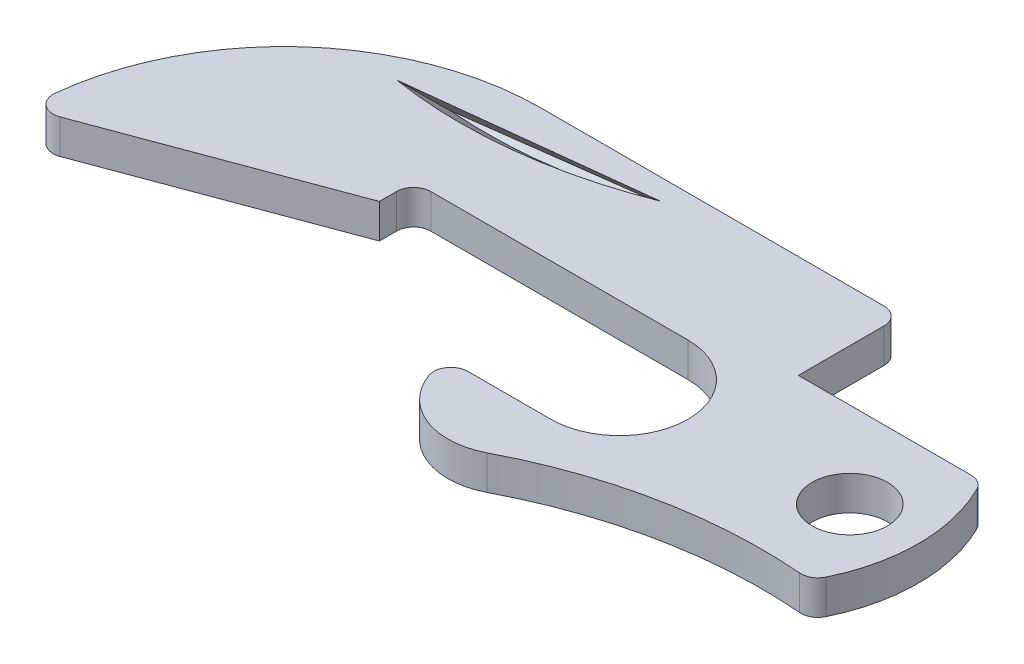
ISO-10303-21;
HEADER;
FILE_DESCRIPTION(('STEP AP214'),'2;1');
FILE_NAME('part.step','',(''),(''),'','','');
FILE_SCHEMA(('AUTOMOTIVE_DESIGN { 1 0 10303 214 1 1 1 1 }'));
ENDSEC;
DATA;
#1=APPLICATION_CONTEXT('core data for automotive mechanical design processes');
#2=APPLICATION_PROTOCOL_DEFINITION('international standard','automotive_design',2000,#1);
#3=PRODUCT_CONTEXT('',#1,'mechanical');
#4=PRODUCT('Part','Part','',(#3));
#5=PRODUCT_RELATED_PRODUCT_CATEGORY('part','',(#4));
#6=PRODUCT_DEFINITION_FORMATION('','',#4);
#7=PRODUCT_DEFINITION_CONTEXT('part definition',#1,'design');
#8=PRODUCT_DEFINITION('design','',#6,#7);
#9=PRODUCT_DEFINITION_SHAPE('','',#8);
#10=(LENGTH_UNIT() NAMED_UNIT(*) SI_UNIT(.MILLI.,.METRE.));
#11=(NAMED_UNIT(*) PLANE_ANGLE_UNIT() SI_UNIT($,.RADIAN.));
#12=(NAMED_UNIT(*) SI_UNIT($,.STERADIAN.) SOLID_ANGLE_UNIT());
#13=UNCERTAINTY_MEASURE_WITH_UNIT(LENGTH_MEASURE(1.E-05),#10,'distance_accuracy_value','');
#14=(GEOMETRIC_REPRESENTATION_CONTEXT(3) GLOBAL_UNCERTAINTY_ASSIGNED_CONTEXT((#13)) GLOBAL_UNIT_ASSIGNED_CONTEXT((#10,
#11,#12)) REPRESENTATION_CONTEXT('',''));
#15=CARTESIAN_POINT('',(0.,0.,0.));
#16=DIRECTION('',(0.,0.,1.));
#17=DIRECTION('',(1.,0.,0.));
#18=AXIS2_PLACEMENT_3D('',#15,#16,#17);
#19=CARTESIAN_POINT('',(-5.49926131403118,1.27,3.175));
#20=DIRECTION('',(0.,1.,0.));
#21=DIRECTION('',(0.,0.,1.));
#22=AXIS2_PLACEMENT_3D('',#19,#20,#21);
#23=PLANE('',#22);
#24=CARTESIAN_POINT('',(-21.1111470257286,1.27,-34.7456603659284));
#25=DIRECTION('',(0.,1.,0.));
#26=DIRECTION('',(0.,0.,1.));
#27=AXIS2_PLACEMENT_3D('',#24,#25,#26);
#28=ELLIPSE('',#27,32.9127154158025,23.1835650445405);
#29=CARTESIAN_POINT('',(-23.6735638427374,1.27000000000007,-2.03459824117952));
#30=VERTEX_POINT('',#29);
#31=CARTESIAN_POINT('',(-14.9129237600392,1.27,-3.03102283684994));
#32=VERTEX_POINT('',#31);
#33=EDGE_CURVE('E11',#30,#32,#28,.T.);
#34=ORIENTED_EDGE('',*,*,#33,.F.);
#35=DIRECTION('',(-0.993593832437609,0.,0.113010159463405));
#36=VECTOR('',#35,1.);
#37=CARTESIAN_POINT('',(-6.31633669052007,1.27,-4.00878824143583));
#38=LINE('',#37,#36);
#39=EDGE_CURVE('E46',#32,#30,#38,.T.);
#40=ORIENTED_EDGE('',*,*,#39,.F.);
#41=EDGE_LOOP('',(#34,#40));
#42=FACE_BOUND('',#41,.T.);
#43=DIRECTION('',(0.,0.,-1.));
#44=VECTOR('',#43,1.);
#45=CARTESIAN_POINT('',(-6.76926131403118,1.27,0.));
#46=LINE('',#45,#44);
#47=CARTESIAN_POINT('',(-6.76926131403118,1.27,0.));
#48=VERTEX_POINT('',#47);
#49=CARTESIAN_POINT('',(-6.76926131403118,1.27,-3.175));
#50=VERTEX_POINT('',#49);
#51=EDGE_CURVE('E205',#48,#50,#46,.T.);
#52=ORIENTED_EDGE('',*,*,#51,.T.);
#53=CARTESIAN_POINT('',(-7.40426131403118,1.27,-3.175));
#54=DIRECTION('',(0.,1.,0.));
#55=DIRECTION('',(0.,0.,1.));
#56=AXIS2_PLACEMENT_3D('',#53,#54,#55);
#57=CIRCLE('',#56,0.635);
#58=CARTESIAN_POINT('',(-7.40426131403118,1.27,-3.81));
#59=VERTEX_POINT('',#58);
#60=EDGE_CURVE('E297',#50,#59,#57,.T.);
#61=ORIENTED_EDGE('',*,*,#60,.T.);
#62=DIRECTION('',(-1.,0.,0.));
#63=VECTOR('',#62,1.);
#64=CARTESIAN_POINT('',(-6.76926131403118,1.27,-3.81));
#65=LINE('',#64,#63);
#66=CARTESIAN_POINT('',(-20.1042613140312,1.27,-3.81));
#67=VERTEX_POINT('',#66);
#68=EDGE_CURVE('E208',#59,#67,#65,.T.);
#69=ORIENTED_EDGE('',*,*,#68,.T.);
#70=CARTESIAN_POINT('',(-20.1042613140312,1.27,5.715));
#71=DIRECTION('',(0.,1.,0.));
#72=DIRECTION('',(0.,0.,1.));
#73=AXIS2_PLACEMENT_3D('',#70,#71,#72);
#74=CIRCLE('',#73,9.525);
#75=CARTESIAN_POINT('',(-29.5768648575385,1.27,4.71729908913937));
#76=VERTEX_POINT('',#75);
#77=EDGE_CURVE('E210',#67,#76,#74,.T.);
#78=ORIENTED_EDGE('',*,*,#77,.T.);
#79=CARTESIAN_POINT('',(-28.945357954638,1.27,4.78381248319674));
#80=DIRECTION('',(0.,1.,0.));
#81=DIRECTION('',(0.,0.,1.));
#82=AXIS2_PLACEMENT_3D('',#79,#80,#81);
#83=CIRCLE('',#82,0.635);
#84=CARTESIAN_POINT('',(-28.7243873064882,1.27,5.37912498319674));
#85=VERTEX_POINT('',#84);
#86=EDGE_CURVE('E295',#76,#85,#83,.T.);
#87=ORIENTED_EDGE('',*,*,#86,.T.);
#88=DIRECTION('',(0.937499999999999,0.,-0.347985272676879));
#89=VECTOR('',#88,1.);
#90=CARTESIAN_POINT('',(-29.6292613140312,1.27,5.715));
#91=LINE('',#90,#89);
#92=CARTESIAN_POINT('',(-20.1042613140312,1.27,2.17946962960292));
#93=VERTEX_POINT('',#92);
#94=EDGE_CURVE('E213',#85,#93,#91,.T.);
#95=ORIENTED_EDGE('',*,*,#94,.T.);
#96=DIRECTION('',(0.,0.,-1.));
#97=VECTOR('',#96,1.);
#98=CARTESIAN_POINT('',(-20.1042613140312,1.27,2.17946962960292));
#99=LINE('',#98,#97);
#100=CARTESIAN_POINT('',(-20.1042613140312,1.27,1.54446962960292));
#101=VERTEX_POINT('',#100);
#102=EDGE_CURVE('E215',#93,#101,#99,.T.);
#103=ORIENTED_EDGE('',*,*,#102,.T.);
#104=CARTESIAN_POINT('',(-19.4692613140312,1.27,1.54446962960292));
#105=DIRECTION('',(0.,1.,0.));
#106=DIRECTION('',(0.,0.,1.));
#107=AXIS2_PLACEMENT_3D('',#104,#105,#106);
#108=CIRCLE('',#107,0.635);
#109=CARTESIAN_POINT('',(-19.4692613140312,1.27,0.909469629602915));
#110=VERTEX_POINT('',#109);
#111=EDGE_CURVE('E325',#101,#110,#108,.F.);
#112=ORIENTED_EDGE('',*,*,#111,.T.);
#113=DIRECTION('',(1.,0.,0.));
#114=VECTOR('',#113,1.);
#115=CARTESIAN_POINT('',(-20.1042613140312,1.27,0.909469629602915));
#116=LINE('',#115,#114);
#117=CARTESIAN_POINT('',(-9.94426131403119,1.27,0.909469629602915));
#118=VERTEX_POINT('',#117);
#119=EDGE_CURVE('E218',#110,#118,#116,.T.);
#120=ORIENTED_EDGE('',*,*,#119,.T.);
#121=CARTESIAN_POINT('',(-9.94426131403119,1.27,3.44946962960292));
#122=DIRECTION('',(0.,-1.,0.));
#123=DIRECTION('',(0.,0.,-1.));
#124=AXIS2_PLACEMENT_3D('',#121,#122,#123);
#125=CIRCLE('',#124,2.54);
#126=CARTESIAN_POINT('',(-9.94426131403119,1.27,5.98946962960292));
#127=VERTEX_POINT('',#126);
#128=EDGE_CURVE('E220',#118,#127,#125,.T.);
#129=ORIENTED_EDGE('',*,*,#128,.T.);
#130=DIRECTION('',(-1.,0.,0.));
#131=VECTOR('',#130,1.);
#132=CARTESIAN_POINT('',(-9.94426131403119,1.27,5.98946962960292));
#133=LINE('',#132,#131);
#134=CARTESIAN_POINT('',(-13.010312538245,1.27,5.98946962960292));
#135=VERTEX_POINT('',#134);
#136=EDGE_CURVE('E222',#127,#135,#133,.T.);
#137=ORIENTED_EDGE('',*,*,#136,.T.);
#138=CARTESIAN_POINT('',(-13.010312538245,1.27,6.62446962960292));
#139=DIRECTION('',(0.,1.,0.));
#140=DIRECTION('',(0.,0.,1.));
#141=AXIS2_PLACEMENT_3D('',#138,#139,#140);
#142=CIRCLE('',#141,0.635);
#143=CARTESIAN_POINT('',(-13.6089962796496,1.27,6.83613629626958));
#144=VERTEX_POINT('',#143);
#145=EDGE_CURVE('E289',#135,#144,#142,.T.);
#146=ORIENTED_EDGE('',*,*,#145,.T.);
#147=CARTESIAN_POINT('',(-11.2142613140312,1.27,5.98946962960292));
#148=DIRECTION('',(0.,1.,0.));
#149=DIRECTION('',(0.,0.,1.));
#150=AXIS2_PLACEMENT_3D('',#147,#148,#149);
#151=CIRCLE('',#150,2.54);
#152=CARTESIAN_POINT('',(-10.0458046094695,1.27,8.24475429668263));
#153=VERTEX_POINT('',#152);
#154=EDGE_CURVE('E225',#144,#153,#151,.T.);
#155=ORIENTED_EDGE('',*,*,#154,.T.);
#156=CARTESIAN_POINT('',(-1.86660767753762,1.27,24.0317469662406));
#157=DIRECTION('',(0.,-1.,0.));
#158=DIRECTION('',(0.,0.,-1.));
#159=AXIS2_PLACEMENT_3D('',#156,#157,#158);
#160=CIRCLE('',#159,17.78);
#161=CARTESIAN_POINT('',(-0.41359624831094,1.27,6.31121769122916));
#162=VERTEX_POINT('',#161);
#163=EDGE_CURVE('E227',#153,#162,#160,.T.);
#164=ORIENTED_EDGE('',*,*,#163,.T.);
#165=CARTESIAN_POINT('',(-0.361702982981415,1.27,5.67834164569303));
#166=DIRECTION('',(0.,1.,0.));
#167=DIRECTION('',(0.,0.,1.));
#168=AXIS2_PLACEMENT_3D('',#165,#166,#167);
#169=CIRCLE('',#168,0.635);
#170=CARTESIAN_POINT('',(0.20913683157967,1.27,5.9564907174367));
#171=VERTEX_POINT('',#170);
#172=EDGE_CURVE('E291',#162,#171,#169,.T.);
#173=ORIENTED_EDGE('',*,*,#172,.T.);
#174=CARTESIAN_POINT('',(-5.49926131403118,1.27,3.175));
#175=DIRECTION('',(0.,1.,0.));
#176=DIRECTION('',(0.,0.,1.));
#177=AXIS2_PLACEMENT_3D('',#174,#175,#176);
#178=CIRCLE('',#177,6.35);
#179=CARTESIAN_POINT('',(0.189109430601681,1.27,0.352777777777778));
#180=VERTEX_POINT('',#179);
#181=EDGE_CURVE('E199',#171,#180,#178,.T.);
#182=ORIENTED_EDGE('',*,*,#181,.T.);
#183=CARTESIAN_POINT('',(-0.379727643861606,1.27,0.635));
#184=DIRECTION('',(0.,1.,0.));
#185=DIRECTION('',(0.,0.,1.));
#186=AXIS2_PLACEMENT_3D('',#183,#184,#185);
#187=CIRCLE('',#186,0.635);
#188=CARTESIAN_POINT('',(-0.379727643861606,1.27,0.));
#189=VERTEX_POINT('',#188);
#190=EDGE_CURVE('E293',#180,#189,#187,.T.);
#191=ORIENTED_EDGE('',*,*,#190,.T.);
#192=DIRECTION('',(-1.,0.,0.));
#193=VECTOR('',#192,1.);
#194=CARTESIAN_POINT('',(0.,1.27,0.));
#195=LINE('',#194,#193);
#196=EDGE_CURVE('E202',#189,#48,#195,.T.);
#197=ORIENTED_EDGE('',*,*,#196,.T.);
#198=EDGE_LOOP('',(#52,#61,#69,#78,#87,#95,#103,#112,#120,#129,#137,#146,#155,#164,#173,#182,
#191,#197));
#199=FACE_BOUND('',#198,.T.);
#200=CARTESIAN_POINT('',(-1.68926131403119,1.27,3.175));
#201=DIRECTION('',(0.,1.,0.));
#202=DIRECTION('',(0.,0.,1.));
#203=AXIS2_PLACEMENT_3D('',#200,#201,#202);
#204=CIRCLE('',#203,1.397);
#205=CARTESIAN_POINT('',(-1.68926131403119,1.27,4.572));
#206=VERTEX_POINT('',#205);
#207=EDGE_CURVE('E193',#206,#206,#204,.T.);
#208=ORIENTED_EDGE('',*,*,#207,.F.);
#209=EDGE_LOOP('',(#208));
#210=FACE_BOUND('',#209,.T.);
#211=ADVANCED_FACE('F38',(#42,#199,#210),#23,.T.);
#212=CARTESIAN_POINT('',(-5.49926131403118,0.,3.175));
#213=DIRECTION('',(0.,1.,0.));
#214=DIRECTION('',(0.,0.,1.));
#215=AXIS2_PLACEMENT_3D('',#212,#213,#214);
#216=PLANE('',#215);
#217=DIRECTION('',(-1.,0.,0.));
#218=VECTOR('',#217,1.);
#219=CARTESIAN_POINT('',(-6.76926131403118,0.,-3.81));
#220=LINE('',#219,#218);
#221=CARTESIAN_POINT('',(-7.40426131403118,0.,-3.81));
#222=VERTEX_POINT('',#221);
#223=CARTESIAN_POINT('',(-20.1042613140312,0.,-3.81));
#224=VERTEX_POINT('',#223);
#225=EDGE_CURVE('E237',#222,#224,#220,.T.);
#226=ORIENTED_EDGE('',*,*,#225,.F.);
#227=CARTESIAN_POINT('',(-7.40426131403118,0.,-3.175));
#228=DIRECTION('',(0.,1.,0.));
#229=DIRECTION('',(0.,0.,1.));
#230=AXIS2_PLACEMENT_3D('',#227,#228,#229);
#231=CIRCLE('',#230,0.635);
#232=CARTESIAN_POINT('',(-6.76926131403118,0.,-3.175));
#233=VERTEX_POINT('',#232);
#234=EDGE_CURVE('E285',#222,#233,#231,.F.);
#235=ORIENTED_EDGE('',*,*,#234,.T.);
#236=DIRECTION('',(0.,0.,-1.));
#237=VECTOR('',#236,1.);
#238=CARTESIAN_POINT('',(-6.76926131403118,0.,0.));
#239=LINE('',#238,#237);
#240=CARTESIAN_POINT('',(-6.76926131403118,0.,0.));
#241=VERTEX_POINT('',#240);
#242=EDGE_CURVE('E234',#241,#233,#239,.T.);
#243=ORIENTED_EDGE('',*,*,#242,.F.);
#244=DIRECTION('',(-1.,0.,0.));
#245=VECTOR('',#244,1.);
#246=CARTESIAN_POINT('',(0.,0.,0.));
#247=LINE('',#246,#245);
#248=CARTESIAN_POINT('',(-0.379727643861606,0.,0.));
#249=VERTEX_POINT('',#248);
#250=EDGE_CURVE('E232',#249,#241,#247,.T.);
#251=ORIENTED_EDGE('',*,*,#250,.F.);
#252=CARTESIAN_POINT('',(-0.379727643861606,0.,0.635));
#253=DIRECTION('',(0.,1.,0.));
#254=DIRECTION('',(0.,0.,1.));
#255=AXIS2_PLACEMENT_3D('',#252,#253,#254);
#256=CIRCLE('',#255,0.635);
#257=CARTESIAN_POINT('',(0.189109430601681,0.,0.352777777777778));
#258=VERTEX_POINT('',#257);
#259=EDGE_CURVE('E281',#249,#258,#256,.F.);
#260=ORIENTED_EDGE('',*,*,#259,.T.);
#261=CARTESIAN_POINT('',(-5.49926131403118,0.,3.175));
#262=DIRECTION('',(0.,1.,0.));
#263=DIRECTION('',(0.,0.,1.));
#264=AXIS2_PLACEMENT_3D('',#261,#262,#263);
#265=CIRCLE('',#264,6.35);
#266=CARTESIAN_POINT('',(0.20913683157967,0.,5.9564907174367));
#267=VERTEX_POINT('',#266);
#268=EDGE_CURVE('E196',#267,#258,#265,.T.);
#269=ORIENTED_EDGE('',*,*,#268,.F.);
#270=CARTESIAN_POINT('',(-0.361702982981415,0.,5.67834164569303));
#271=DIRECTION('',(0.,1.,0.));
#272=DIRECTION('',(0.,0.,1.));
#273=AXIS2_PLACEMENT_3D('',#270,#271,#272);
#274=CIRCLE('',#273,0.635);
#275=CARTESIAN_POINT('',(-0.41359624831094,0.,6.31121769122916));
#276=VERTEX_POINT('',#275);
#277=EDGE_CURVE('E279',#267,#276,#274,.F.);
#278=ORIENTED_EDGE('',*,*,#277,.T.);
#279=CARTESIAN_POINT('',(-1.86660767753762,0.,24.0317469662406));
#280=DIRECTION('',(0.,-1.,0.));
#281=DIRECTION('',(0.,0.,-1.));
#282=AXIS2_PLACEMENT_3D('',#279,#280,#281);
#283=CIRCLE('',#282,17.78);
#284=CARTESIAN_POINT('',(-10.0458046094695,0.,8.24475429668263));
#285=VERTEX_POINT('',#284);
#286=EDGE_CURVE('E203',#285,#276,#283,.T.);
#287=ORIENTED_EDGE('',*,*,#286,.F.);
#288=CARTESIAN_POINT('',(-11.2142613140312,0.,5.98946962960292));
#289=DIRECTION('',(0.,1.,0.));
#290=DIRECTION('',(0.,0.,1.));
#291=AXIS2_PLACEMENT_3D('',#288,#289,#290);
#292=CIRCLE('',#291,2.54);
#293=CARTESIAN_POINT('',(-13.6089962796496,0.,6.83613629626958));
#294=VERTEX_POINT('',#293);
#295=EDGE_CURVE('E254',#294,#285,#292,.T.);
#296=ORIENTED_EDGE('',*,*,#295,.F.);
#297=CARTESIAN_POINT('',(-13.010312538245,0.,6.62446962960292));
#298=DIRECTION('',(0.,1.,0.));
#299=DIRECTION('',(0.,0.,1.));
#300=AXIS2_PLACEMENT_3D('',#297,#298,#299);
#301=CIRCLE('',#300,0.635);
#302=CARTESIAN_POINT('',(-13.010312538245,0.,5.98946962960292));
#303=VERTEX_POINT('',#302);
#304=EDGE_CURVE('E277',#294,#303,#301,.F.);
#305=ORIENTED_EDGE('',*,*,#304,.T.);
#306=DIRECTION('',(-1.,0.,0.));
#307=VECTOR('',#306,1.);
#308=CARTESIAN_POINT('',(-9.94426131403119,0.,5.98946962960292));
#309=LINE('',#308,#307);
#310=CARTESIAN_POINT('',(-9.94426131403119,0.,5.98946962960292));
#311=VERTEX_POINT('',#310);
#312=EDGE_CURVE('E251',#311,#303,#309,.T.);
#313=ORIENTED_EDGE('',*,*,#312,.F.);
#314=CARTESIAN_POINT('',(-9.94426131403119,0.,3.44946962960292));
#315=DIRECTION('',(0.,-1.,0.));
#316=DIRECTION('',(0.,0.,-1.));
#317=AXIS2_PLACEMENT_3D('',#314,#315,#316);
#318=CIRCLE('',#317,2.54);
#319=CARTESIAN_POINT('',(-9.94426131403119,0.,0.909469629602915));
#320=VERTEX_POINT('',#319);
#321=EDGE_CURVE('E249',#320,#311,#318,.T.);
#322=ORIENTED_EDGE('',*,*,#321,.F.);
#323=DIRECTION('',(1.,0.,0.));
#324=VECTOR('',#323,1.);
#325=CARTESIAN_POINT('',(-20.1042613140312,0.,0.909469629602915));
#326=LINE('',#325,#324);
#327=CARTESIAN_POINT('',(-19.4692613140312,0.,0.909469629602915));
#328=VERTEX_POINT('',#327);
#329=EDGE_CURVE('E247',#328,#320,#326,.T.);
#330=ORIENTED_EDGE('',*,*,#329,.F.);
#331=CARTESIAN_POINT('',(-19.4692613140312,0.,1.54446962960292));
#332=DIRECTION('',(0.,1.,0.));
#333=DIRECTION('',(0.,0.,1.));
#334=AXIS2_PLACEMENT_3D('',#331,#332,#333);
#335=CIRCLE('',#334,0.635);
#336=CARTESIAN_POINT('',(-20.1042613140312,0.,1.54446962960292));
#337=VERTEX_POINT('',#336);
#338=EDGE_CURVE('E323',#328,#337,#335,.T.);
#339=ORIENTED_EDGE('',*,*,#338,.T.);
#340=DIRECTION('',(0.,0.,-1.));
#341=VECTOR('',#340,1.);
#342=CARTESIAN_POINT('',(-20.1042613140312,0.,2.17946962960292));
#343=LINE('',#342,#341);
#344=CARTESIAN_POINT('',(-20.1042613140312,0.,2.17946962960292));
#345=VERTEX_POINT('',#344);
#346=EDGE_CURVE('E244',#345,#337,#343,.T.);
#347=ORIENTED_EDGE('',*,*,#346,.F.);
#348=DIRECTION('',(0.937499999999999,0.,-0.347985272676879));
#349=VECTOR('',#348,1.);
#350=CARTESIAN_POINT('',(-29.6292613140312,0.,5.715));
#351=LINE('',#350,#349);
#352=CARTESIAN_POINT('',(-28.7243873064882,0.,5.37912498319674));
#353=VERTEX_POINT('',#352);
#354=EDGE_CURVE('E242',#353,#345,#351,.T.);
#355=ORIENTED_EDGE('',*,*,#354,.F.);
#356=CARTESIAN_POINT('',(-28.945357954638,0.,4.78381248319674));
#357=DIRECTION('',(0.,1.,0.));
#358=DIRECTION('',(0.,0.,1.));
#359=AXIS2_PLACEMENT_3D('',#356,#357,#358);
#360=CIRCLE('',#359,0.635);
#361=CARTESIAN_POINT('',(-29.5768648575385,0.,4.71729908913937));
#362=VERTEX_POINT('',#361);
#363=EDGE_CURVE('E283',#353,#362,#360,.F.);
#364=ORIENTED_EDGE('',*,*,#363,.T.);
#365=CARTESIAN_POINT('',(-20.1042613140312,0.,5.715));
#366=DIRECTION('',(0.,1.,0.));
#367=DIRECTION('',(0.,0.,1.));
#368=AXIS2_PLACEMENT_3D('',#365,#366,#367);
#369=CIRCLE('',#368,9.525);
#370=EDGE_CURVE('E239',#224,#362,#369,.T.);
#371=ORIENTED_EDGE('',*,*,#370,.F.);
#372=EDGE_LOOP('',(#226,#235,#243,#251,#260,#269,#278,#287,#296,#305,#313,#322,#330,#339,#347,
#355,#364,#371));
#373=FACE_BOUND('',#372,.T.);
#374=CARTESIAN_POINT('',(-1.68926131403119,0.,3.175));
#375=DIRECTION('',(0.,1.,0.));
#376=DIRECTION('',(0.,0.,1.));
#377=AXIS2_PLACEMENT_3D('',#374,#375,#376);
#378=CIRCLE('',#377,1.397);
#379=CARTESIAN_POINT('',(-1.68926131403119,0.,4.572));
#380=VERTEX_POINT('',#379);
#381=EDGE_CURVE('E182',#380,#380,#378,.T.);
#382=ORIENTED_EDGE('',*,*,#381,.T.);
#383=EDGE_LOOP('',(#382));
#384=FACE_BOUND('',#383,.T.);
#385=ADVANCED_FACE('F342',(#373,#384),#216,.F.);
#386=CARTESIAN_POINT('',(-5.49926131403118,1.27,3.175));
#387=DIRECTION('',(0.,-1.,0.));
#388=DIRECTION('',(0.,0.,-1.));
#389=AXIS2_PLACEMENT_3D('',#386,#387,#388);
#390=CYLINDRICAL_SURFACE('',#389,6.35);
#391=ORIENTED_EDGE('',*,*,#268,.T.);
#392=DIRECTION('',(0.,-1.,0.));
#393=VECTOR('',#392,1.);
#394=CARTESIAN_POINT('',(0.189109430601681,1.27,0.352777777777778));
#395=LINE('',#394,#393);
#396=EDGE_CURVE('E310',#258,#180,#395,.F.);
#397=ORIENTED_EDGE('',*,*,#396,.T.);
#398=ORIENTED_EDGE('',*,*,#181,.F.);
#399=DIRECTION('',(0.,-1.,0.));
#400=VECTOR('',#399,1.);
#401=CARTESIAN_POINT('',(0.209136831579671,1.27,5.9564907174367));
#402=LINE('',#401,#400);
#403=EDGE_CURVE('E307',#171,#267,#402,.T.);
#404=ORIENTED_EDGE('',*,*,#403,.T.);
#405=EDGE_LOOP('',(#391,#397,#398,#404));
#406=FACE_BOUND('',#405,.T.);
#407=ADVANCED_FACE('F397',(#406),#390,.T.);
#408=CARTESIAN_POINT('',(0.,1.27,0.));
#409=DIRECTION('',(0.,0.,1.));
#410=DIRECTION('',(1.,0.,0.));
#411=AXIS2_PLACEMENT_3D('',#408,#409,#410);
#412=PLANE('',#411);
#413=ORIENTED_EDGE('',*,*,#196,.F.);
#414=DIRECTION('',(0.,-1.,0.));
#415=VECTOR('',#414,1.);
#416=CARTESIAN_POINT('',(-0.379727643861606,1.27,0.));
#417=LINE('',#416,#415);
#418=EDGE_CURVE('E304',#189,#249,#417,.T.);
#419=ORIENTED_EDGE('',*,*,#418,.T.);
#420=ORIENTED_EDGE('',*,*,#250,.T.);
#421=DIRECTION('',(0.,-1.,0.));
#422=VECTOR('',#421,1.);
#423=CARTESIAN_POINT('',(-6.76926131403118,1.27,0.));
#424=LINE('',#423,#422);
#425=EDGE_CURVE('E271',#48,#241,#424,.T.);
#426=ORIENTED_EDGE('',*,*,#425,.F.);
#427=EDGE_LOOP('',(#413,#419,#420,#426));
#428=FACE_BOUND('',#427,.T.);
#429=ADVANCED_FACE('F427',(#428),#412,.F.);
#430=CARTESIAN_POINT('',(-6.76926131403118,1.27,0.));
#431=DIRECTION('',(-1.,0.,0.));
#432=DIRECTION('',(0.,0.,1.));
#433=AXIS2_PLACEMENT_3D('',#430,#431,#432);
#434=PLANE('',#433);
#435=ORIENTED_EDGE('',*,*,#242,.T.);
#436=DIRECTION('',(0.,-1.,0.));
#437=VECTOR('',#436,1.);
#438=CARTESIAN_POINT('',(-6.76926131403118,1.27,-3.175));
#439=LINE('',#438,#437);
#440=EDGE_CURVE('E287',#233,#50,#439,.F.);
#441=ORIENTED_EDGE('',*,*,#440,.T.);
#442=ORIENTED_EDGE('',*,*,#51,.F.);
#443=ORIENTED_EDGE('',*,*,#425,.T.);
#444=EDGE_LOOP('',(#435,#441,#442,#443));
#445=FACE_BOUND('',#444,.T.);
#446=ADVANCED_FACE('F372',(#445),#434,.F.);
#447=CARTESIAN_POINT('',(-6.76926131403118,1.27,-3.81));
#448=DIRECTION('',(0.,0.,1.));
#449=DIRECTION('',(1.,0.,0.));
#450=AXIS2_PLACEMENT_3D('',#447,#448,#449);
#451=PLANE('',#450);
#452=ORIENTED_EDGE('',*,*,#68,.F.);
#453=DIRECTION('',(0.,-1.,0.));
#454=VECTOR('',#453,1.);
#455=CARTESIAN_POINT('',(-7.40426131403118,1.27,-3.81));
#456=LINE('',#455,#454);
#457=EDGE_CURVE('E274',#59,#222,#456,.T.);
#458=ORIENTED_EDGE('',*,*,#457,.T.);
#459=ORIENTED_EDGE('',*,*,#225,.T.);
#460=DIRECTION('',(0.,-1.,0.));
#461=VECTOR('',#460,1.);
#462=CARTESIAN_POINT('',(-20.1042613140312,1.27,-3.81));
#463=LINE('',#462,#461);
#464=EDGE_CURVE('E268',#67,#224,#463,.T.);
#465=ORIENTED_EDGE('',*,*,#464,.F.);
#466=EDGE_LOOP('',(#452,#458,#459,#465));
#467=FACE_BOUND('',#466,.T.);
#468=ADVANCED_FACE('F366',(#467),#451,.F.);
#469=CARTESIAN_POINT('',(-20.1042613140312,1.27,5.715));
#470=DIRECTION('',(0.,-1.,0.));
#471=DIRECTION('',(0.,0.,-1.));
#472=AXIS2_PLACEMENT_3D('',#469,#470,#471);
#473=CYLINDRICAL_SURFACE('',#472,9.525);
#474=ORIENTED_EDGE('',*,*,#370,.T.);
#475=DIRECTION('',(0.,-1.,0.));
#476=VECTOR('',#475,1.);
#477=CARTESIAN_POINT('',(-29.5768648575385,1.27,4.71729908913937));
#478=LINE('',#477,#476);
#479=EDGE_CURVE('E302',#362,#76,#478,.F.);
#480=ORIENTED_EDGE('',*,*,#479,.T.);
#481=ORIENTED_EDGE('',*,*,#77,.F.);
#482=ORIENTED_EDGE('',*,*,#464,.T.);
#483=EDGE_LOOP('',(#474,#480,#481,#482));
#484=FACE_BOUND('',#483,.T.);
#485=ADVANCED_FACE('F357',(#484),#473,.T.);
#486=CARTESIAN_POINT('',(-29.6292613140312,1.27,5.715));
#487=DIRECTION('',(-0.347985272676879,0.,-0.937499999999999));
#488=DIRECTION('',(-0.937499999999999,0.,0.347985272676879));
#489=AXIS2_PLACEMENT_3D('',#486,#487,#488);
#490=PLANE('',#489);
#491=ORIENTED_EDGE('',*,*,#94,.F.);
#492=DIRECTION('',(0.,-1.,0.));
#493=VECTOR('',#492,1.);
#494=CARTESIAN_POINT('',(-28.7243873064882,1.27,5.37912498319674));
#495=LINE('',#494,#493);
#496=EDGE_CURVE('E299',#85,#353,#495,.T.);
#497=ORIENTED_EDGE('',*,*,#496,.T.);
#498=ORIENTED_EDGE('',*,*,#354,.T.);
#499=DIRECTION('',(0.,-1.,0.));
#500=VECTOR('',#499,1.);
#501=CARTESIAN_POINT('',(-20.1042613140312,1.27,2.17946962960292));
#502=LINE('',#501,#500);
#503=EDGE_CURVE('E265',#93,#345,#502,.T.);
#504=ORIENTED_EDGE('',*,*,#503,.F.);
#505=EDGE_LOOP('',(#491,#497,#498,#504));
#506=FACE_BOUND('',#505,.T.);
#507=ADVANCED_FACE('F351',(#506),#490,.F.);
#508=CARTESIAN_POINT('',(-20.1042613140312,1.27,2.17946962960292));
#509=DIRECTION('',(-1.,0.,0.));
#510=DIRECTION('',(0.,0.,1.));
#511=AXIS2_PLACEMENT_3D('',#508,#509,#510);
#512=PLANE('',#511);
#513=ORIENTED_EDGE('',*,*,#346,.T.);
#514=DIRECTION('',(0.,-1.,0.));
#515=VECTOR('',#514,1.);
#516=CARTESIAN_POINT('',(-20.1042613140312,1.27,1.54446962960292));
#517=LINE('',#516,#515);
#518=EDGE_CURVE('E321',#337,#101,#517,.F.);
#519=ORIENTED_EDGE('',*,*,#518,.T.);
#520=ORIENTED_EDGE('',*,*,#102,.F.);
#521=ORIENTED_EDGE('',*,*,#503,.T.);
#522=EDGE_LOOP('',(#513,#519,#520,#521));
#523=FACE_BOUND('',#522,.T.);
#524=ADVANCED_FACE('F347',(#523),#512,.F.);
#525=CARTESIAN_POINT('',(-20.1042613140312,1.27,0.909469629602915));
#526=DIRECTION('',(0.,0.,-1.));
#527=DIRECTION('',(-1.,0.,0.));
#528=AXIS2_PLACEMENT_3D('',#525,#526,#527);
#529=PLANE('',#528);
#530=ORIENTED_EDGE('',*,*,#119,.F.);
#531=DIRECTION('',(0.,-1.,0.));
#532=VECTOR('',#531,1.);
#533=CARTESIAN_POINT('',(-19.4692613140312,0.,0.909469629602915));
#534=LINE('',#533,#532);
#535=EDGE_CURVE('E318',#110,#328,#534,.T.);
#536=ORIENTED_EDGE('',*,*,#535,.T.);
#537=ORIENTED_EDGE('',*,*,#329,.T.);
#538=DIRECTION('',(0.,-1.,0.));
#539=VECTOR('',#538,1.);
#540=CARTESIAN_POINT('',(-9.94426131403119,1.27,0.909469629602915));
#541=LINE('',#540,#539);
#542=EDGE_CURVE('E262',#118,#320,#541,.T.);
#543=ORIENTED_EDGE('',*,*,#542,.F.);
#544=EDGE_LOOP('',(#530,#536,#537,#543));
#545=FACE_BOUND('',#544,.T.);
#546=ADVANCED_FACE('F336',(#545),#529,.F.);
#547=CARTESIAN_POINT('',(-9.94426131403119,1.27,3.44946962960292));
#548=DIRECTION('',(0.,-1.,0.));
#549=DIRECTION('',(0.,0.,-1.));
#550=AXIS2_PLACEMENT_3D('',#547,#548,#549);
#551=CYLINDRICAL_SURFACE('',#550,2.54);
#552=ORIENTED_EDGE('',*,*,#321,.T.);
#553=DIRECTION('',(0.,-1.,0.));
#554=VECTOR('',#553,1.);
#555=CARTESIAN_POINT('',(-9.94426131403119,1.27,5.98946962960292));
#556=LINE('',#555,#554);
#557=EDGE_CURVE('E259',#127,#311,#556,.T.);
#558=ORIENTED_EDGE('',*,*,#557,.F.);
#559=ORIENTED_EDGE('',*,*,#128,.F.);
#560=ORIENTED_EDGE('',*,*,#542,.T.);
#561=EDGE_LOOP('',(#552,#558,#559,#560));
#562=FACE_BOUND('',#561,.T.);
#563=ADVANCED_FACE('F410',(#562),#551,.F.);
#564=CARTESIAN_POINT('',(-9.94426131403119,1.27,5.98946962960292));
#565=DIRECTION('',(0.,0.,1.));
#566=DIRECTION('',(1.,0.,0.));
#567=AXIS2_PLACEMENT_3D('',#564,#565,#566);
#568=PLANE('',#567);
#569=ORIENTED_EDGE('',*,*,#312,.T.);
#570=DIRECTION('',(0.,-1.,0.));
#571=VECTOR('',#570,1.);
#572=CARTESIAN_POINT('',(-13.010312538245,1.27,5.98946962960292));
#573=LINE('',#572,#571);
#574=EDGE_CURVE('E316',#303,#135,#573,.F.);
#575=ORIENTED_EDGE('',*,*,#574,.T.);
#576=ORIENTED_EDGE('',*,*,#136,.F.);
#577=ORIENTED_EDGE('',*,*,#557,.T.);
#578=EDGE_LOOP('',(#569,#575,#576,#577));
#579=FACE_BOUND('',#578,.T.);
#580=ADVANCED_FACE('F406',(#579),#568,.F.);
#581=CARTESIAN_POINT('',(-11.2142613140312,1.27,5.98946962960292));
#582=DIRECTION('',(0.,-1.,0.));
#583=DIRECTION('',(0.,0.,-1.));
#584=AXIS2_PLACEMENT_3D('',#581,#582,#583);
#585=CYLINDRICAL_SURFACE('',#584,2.54);
#586=ORIENTED_EDGE('',*,*,#154,.F.);
#587=DIRECTION('',(0.,-1.,0.));
#588=VECTOR('',#587,1.);
#589=CARTESIAN_POINT('',(-13.6089962796496,1.27,6.83613629626958));
#590=LINE('',#589,#588);
#591=EDGE_CURVE('E313',#144,#294,#590,.T.);
#592=ORIENTED_EDGE('',*,*,#591,.T.);
#593=ORIENTED_EDGE('',*,*,#295,.T.);
#594=DIRECTION('',(0.,-1.,0.));
#595=VECTOR('',#594,1.);
#596=CARTESIAN_POINT('',(-10.0458046094695,1.27,8.24475429668263));
#597=LINE('',#596,#595);
#598=EDGE_CURVE('E229',#153,#285,#597,.T.);
#599=ORIENTED_EDGE('',*,*,#598,.F.);
#600=EDGE_LOOP('',(#586,#592,#593,#599));
#601=FACE_BOUND('',#600,.T.);
#602=ADVANCED_FACE('F403',(#601),#585,.T.);
#603=CARTESIAN_POINT('',(-1.86660767753762,1.27,24.0317469662406));
#604=DIRECTION('',(0.,-1.,0.));
#605=DIRECTION('',(0.,0.,-1.));
#606=AXIS2_PLACEMENT_3D('',#603,#604,#605);
#607=CYLINDRICAL_SURFACE('',#606,17.78);
#608=ORIENTED_EDGE('',*,*,#286,.T.);
#609=DIRECTION('',(0.,-1.,0.));
#610=VECTOR('',#609,1.);
#611=CARTESIAN_POINT('',(-0.41359624831094,1.27,6.31121769122915));
#612=LINE('',#611,#610);
#613=EDGE_CURVE('E60',#276,#162,#612,.F.);
#614=ORIENTED_EDGE('',*,*,#613,.T.);
#615=ORIENTED_EDGE('',*,*,#163,.F.);
#616=ORIENTED_EDGE('',*,*,#598,.T.);
#617=EDGE_LOOP('',(#608,#614,#615,#616));
#618=FACE_BOUND('',#617,.T.);
#619=ADVANCED_FACE('F385',(#618),#607,.F.);
#620=CARTESIAN_POINT('',(-1.68926131403119,1.27,3.175));
#621=DIRECTION('',(0.,-1.,0.));
#622=DIRECTION('',(0.,0.,-1.));
#623=AXIS2_PLACEMENT_3D('',#620,#621,#622);
#624=CYLINDRICAL_SURFACE('',#623,1.397);
#625=ORIENTED_EDGE('',*,*,#207,.T.);
#626=EDGE_LOOP('',(#625));
#627=FACE_BOUND('',#626,.T.);
#628=ORIENTED_EDGE('',*,*,#381,.F.);
#629=EDGE_LOOP('',(#628));
#630=FACE_BOUND('',#629,.T.);
#631=ADVANCED_FACE('F377',(#627,#630),#624,.F.);
#632=CARTESIAN_POINT('',(-7.40426131403118,1.27,-3.175));
#633=DIRECTION('',(0.,-1.,0.));
#634=DIRECTION('',(0.,0.,-1.));
#635=AXIS2_PLACEMENT_3D('',#632,#633,#634);
#636=CYLINDRICAL_SURFACE('',#635,0.635);
#637=ORIENTED_EDGE('',*,*,#60,.F.);
#638=ORIENTED_EDGE('',*,*,#440,.F.);
#639=ORIENTED_EDGE('',*,*,#234,.F.);
#640=ORIENTED_EDGE('',*,*,#457,.F.);
#641=EDGE_LOOP('',(#637,#638,#639,#640));
#642=FACE_BOUND('',#641,.T.);
#643=ADVANCED_FACE('F375',(#642),#636,.T.);
#644=CARTESIAN_POINT('',(-28.945357954638,1.27,4.78381248319674));
#645=DIRECTION('',(0.,-1.,0.));
#646=DIRECTION('',(0.,0.,-1.));
#647=AXIS2_PLACEMENT_3D('',#644,#645,#646);
#648=CYLINDRICAL_SURFACE('',#647,0.635);
#649=ORIENTED_EDGE('',*,*,#86,.F.);
#650=ORIENTED_EDGE('',*,*,#479,.F.);
#651=ORIENTED_EDGE('',*,*,#363,.F.);
#652=ORIENTED_EDGE('',*,*,#496,.F.);
#653=EDGE_LOOP('',(#649,#650,#651,#652));
#654=FACE_BOUND('',#653,.T.);
#655=ADVANCED_FACE('F361',(#654),#648,.T.);
#656=CARTESIAN_POINT('',(-0.379727643861606,1.27,0.635));
#657=DIRECTION('',(0.,-1.,0.));
#658=DIRECTION('',(0.,0.,-1.));
#659=AXIS2_PLACEMENT_3D('',#656,#657,#658);
#660=CYLINDRICAL_SURFACE('',#659,0.635);
#661=ORIENTED_EDGE('',*,*,#190,.F.);
#662=ORIENTED_EDGE('',*,*,#396,.F.);
#663=ORIENTED_EDGE('',*,*,#259,.F.);
#664=ORIENTED_EDGE('',*,*,#418,.F.);
#665=EDGE_LOOP('',(#661,#662,#663,#664));
#666=FACE_BOUND('',#665,.T.);
#667=ADVANCED_FACE('F383',(#666),#660,.T.);
#668=CARTESIAN_POINT('',(-0.361702982981415,1.27,5.67834164569303));
#669=DIRECTION('',(0.,1.,0.));
#670=DIRECTION('',(0.,0.,1.));
#671=AXIS2_PLACEMENT_3D('',#668,#669,#670);
#672=CYLINDRICAL_SURFACE('',#671,0.635);
#673=ORIENTED_EDGE('',*,*,#172,.F.);
#674=ORIENTED_EDGE('',*,*,#613,.F.);
#675=ORIENTED_EDGE('',*,*,#277,.F.);
#676=ORIENTED_EDGE('',*,*,#403,.F.);
#677=EDGE_LOOP('',(#673,#674,#675,#676));
#678=FACE_BOUND('',#677,.T.);
#679=ADVANCED_FACE('F444',(#678),#672,.T.);
#680=CARTESIAN_POINT('',(-13.010312538245,1.27,6.62446962960292));
#681=DIRECTION('',(0.,-1.,0.));
#682=DIRECTION('',(0.,0.,-1.));
#683=AXIS2_PLACEMENT_3D('',#680,#681,#682);
#684=CYLINDRICAL_SURFACE('',#683,0.635);
#685=ORIENTED_EDGE('',*,*,#145,.F.);
#686=ORIENTED_EDGE('',*,*,#574,.F.);
#687=ORIENTED_EDGE('',*,*,#304,.F.);
#688=ORIENTED_EDGE('',*,*,#591,.F.);
#689=EDGE_LOOP('',(#685,#686,#687,#688));
#690=FACE_BOUND('',#689,.T.);
#691=ADVANCED_FACE('F456',(#690),#684,.T.);
#692=CARTESIAN_POINT('',(-19.4692613140312,1.27,1.54446962960292));
#693=DIRECTION('',(0.,1.,0.));
#694=DIRECTION('',(0.,0.,1.));
#695=AXIS2_PLACEMENT_3D('',#692,#693,#694);
#696=CYLINDRICAL_SURFACE('',#695,0.635);
#697=ORIENTED_EDGE('',*,*,#111,.F.);
#698=ORIENTED_EDGE('',*,*,#518,.F.);
#699=ORIENTED_EDGE('',*,*,#338,.F.);
#700=ORIENTED_EDGE('',*,*,#535,.F.);
#701=EDGE_LOOP('',(#697,#698,#699,#700));
#702=FACE_BOUND('',#701,.T.);
#703=ADVANCED_FACE('F40',(#702),#696,.F.);
#704=CARTESIAN_POINT('',(-21.1111470257286,19.9023097401345,-18.9928401105315));
#705=DIRECTION('',(0.,0.707106781186546,0.707106781186549));
#706=DIRECTION('',(0.,-0.707106781186549,0.707106781186546));
#707=AXIS2_PLACEMENT_3D('',#704,#705,#706);
#708=CONICAL_SURFACE('',#707,25.4,0.0872664625997167);
#709=ORIENTED_EDGE('',*,*,#33,.T.);
#710=CARTESIAN_POINT('',(-15.3655800181709,0.936101307308125,-3.25952388129009));
#711=CARTESIAN_POINT('',(-15.1641109929099,1.07664608895753,-3.16458705678299));
#712=CARTESIAN_POINT('',(-14.9696606954777,1.222963243707,-3.06401159588716));
#713=CARTESIAN_POINT('',(-14.5938677202183,1.52434608371288,-2.85403388345681));
#714=CARTESIAN_POINT('',(-14.4124839831975,1.67938136981047,-2.74466179269289));
#715=CARTESIAN_POINT('',(-14.0606450059535,1.99630874331306,-2.51892495177421));
#716=CARTESIAN_POINT('',(-13.8901862297411,2.15819858370249,-2.40256248799897));
#717=CARTESIAN_POINT('',(-13.5582789412185,2.48803308227772,-2.16373556949713));
#718=CARTESIAN_POINT('',(-13.3968620050834,2.65599595149772,-2.04125225275166));
#719=CARTESIAN_POINT('',(-13.239594841972,2.82602990203158,-1.91656027242867));
#720=B_SPLINE_CURVE_WITH_KNOTS('',3,(#710,#711,#712,#713,#714,#715,#716,#717,#718,#719),
.UNSPECIFIED.,.F.,.F.,(4,2,2,2,4),(0.,0.789479838801412,1.57635962731284,2.36298343339505,
3.15220201206883),.UNSPECIFIED.);
#721=CARTESIAN_POINT('',(-15.3655800181709,0.936101307308125,-3.25952388129009));
#722=VERTEX_POINT('',#721);
#723=EDGE_CURVE('E53',#722,#32,#720,.T.);
#724=ORIENTED_EDGE('',*,*,#723,.F.);
#725=CARTESIAN_POINT('',(-21.1111470257286,18.285863638342,-20.6092862123239));
#726=DIRECTION('',(0.,0.707106781186546,0.707106781186549));
#727=DIRECTION('',(0.,-0.707106781186549,0.707106781186546));
#728=AXIS2_PLACEMENT_3D('',#725,#726,#727);
#729=CIRCLE('',#728,25.2000009151797);
#730=CARTESIAN_POINT('',(-22.5087475282003,0.494197626406108,-2.81762020038808));
#731=VERTEX_POINT('',#730);
#732=EDGE_CURVE('E185',#731,#722,#729,.T.);
#733=ORIENTED_EDGE('',*,*,#732,.F.);
#734=CARTESIAN_POINT('',(-22.5087475282003,0.494197626406108,-2.81762020038808));
#735=CARTESIAN_POINT('',(-22.7127558871702,0.609658025201201,-2.69759899302665));
#736=CARTESIAN_POINT('',(-22.9098685697951,0.731751595392509,-2.57279994757266));
#737=CARTESIAN_POINT('',(-23.2911758402446,0.986297316582272,-2.31598511632622));
#738=CARTESIAN_POINT('',(-23.4754108342103,1.1187140286645,-2.18399445154696));
#739=CARTESIAN_POINT('',(-23.8331016720507,1.39174717225365,-1.91436338071483));
#740=CARTESIAN_POINT('',(-24.0065610030286,1.53236092226962,-1.77672482656611));
#741=CARTESIAN_POINT('',(-24.3446004949487,1.82074994894876,-1.49645243616815));
#742=CARTESIAN_POINT('',(-24.5091494794959,1.96854731876028,-1.3538036200142));
#743=CARTESIAN_POINT('',(-24.669594841972,2.11892635649408,-1.20945672689117));
#744=B_SPLINE_CURVE_WITH_KNOTS('',3,(#734,#735,#736,#737,#738,#739,#740,#741,#742,#743),
.UNSPECIFIED.,.F.,.F.,(4,2,2,2,4),(0.,0.789479838801418,1.57635962731285,2.36298343339506,
3.15220201206885),.UNSPECIFIED.);
#745=EDGE_CURVE('E174',#731,#30,#744,.T.);
#746=ORIENTED_EDGE('',*,*,#745,.T.);
#747=EDGE_LOOP('',(#709,#724,#733,#746));
#748=FACE_BOUND('',#747,.T.);
#749=ADVANCED_FACE('F186',(#748),#708,.F.);
#750=CARTESIAN_POINT('',(-24.669594841972,2.11892635649409,-1.20945672689116));
#751=DIRECTION('',(-0.0868240888334586,0.640107094037066,-0.763363927469502));
#752=DIRECTION('',(0.,0.766257577820651,0.642533520084695));
#753=AXIS2_PLACEMENT_3D('',#750,#751,#752);
#754=PLANE('',#753);
#755=ORIENTED_EDGE('',*,*,#39,.T.);
#756=ORIENTED_EDGE('',*,*,#745,.F.);
#757=DIRECTION('',(-0.996194698091746,-0.0616284167162148,0.0616284167162145));
#758=VECTOR('',#757,1.);
#759=CARTESIAN_POINT('',(-18.9371637731857,0.715149466857117,-3.03857204083909));
#760=LINE('',#759,#758);
#761=EDGE_CURVE('E178',#722,#731,#760,.T.);
#762=ORIENTED_EDGE('',*,*,#761,.F.);
#763=ORIENTED_EDGE('',*,*,#723,.T.);
#764=EDGE_LOOP('',(#755,#756,#762,#763));
#765=FACE_BOUND('',#764,.T.);
#766=ADVANCED_FACE('F176',(#765),#754,.F.);
#767=CARTESIAN_POINT('',(-21.1111470257286,18.285863638342,-20.6092862123239));
#768=DIRECTION('',(0.,0.707106781186546,0.707106781186549));
#769=DIRECTION('',(0.,-0.707106781186549,0.707106781186546));
#770=AXIS2_PLACEMENT_3D('',#767,#768,#769);
#771=PLANE('',#770);
#772=ORIENTED_EDGE('',*,*,#732,.T.);
#773=ORIENTED_EDGE('',*,*,#761,.T.);
#774=EDGE_LOOP('',(#772,#773));
#775=FACE_BOUND('',#774,.T.);
#776=ADVANCED_FACE('F189',(#775),#771,.T.);
#777=CLOSED_SHELL('',(#211,#385,#407,#429,#446,#468,#485,#507,#524,#546,#563,#580,#602,#619,
#631,#643,#655,#667,#679,#691,#703,#749,#766,#776));
#778=MANIFOLD_SOLID_BREP('B2',#777);
#779=ADVANCED_BREP_SHAPE_REPRESENTATION('',(#18,#778),#14);
#780=SHAPE_DEFINITION_REPRESENTATION(#9,#779);
ENDSEC;
END-ISO-10303-21;
